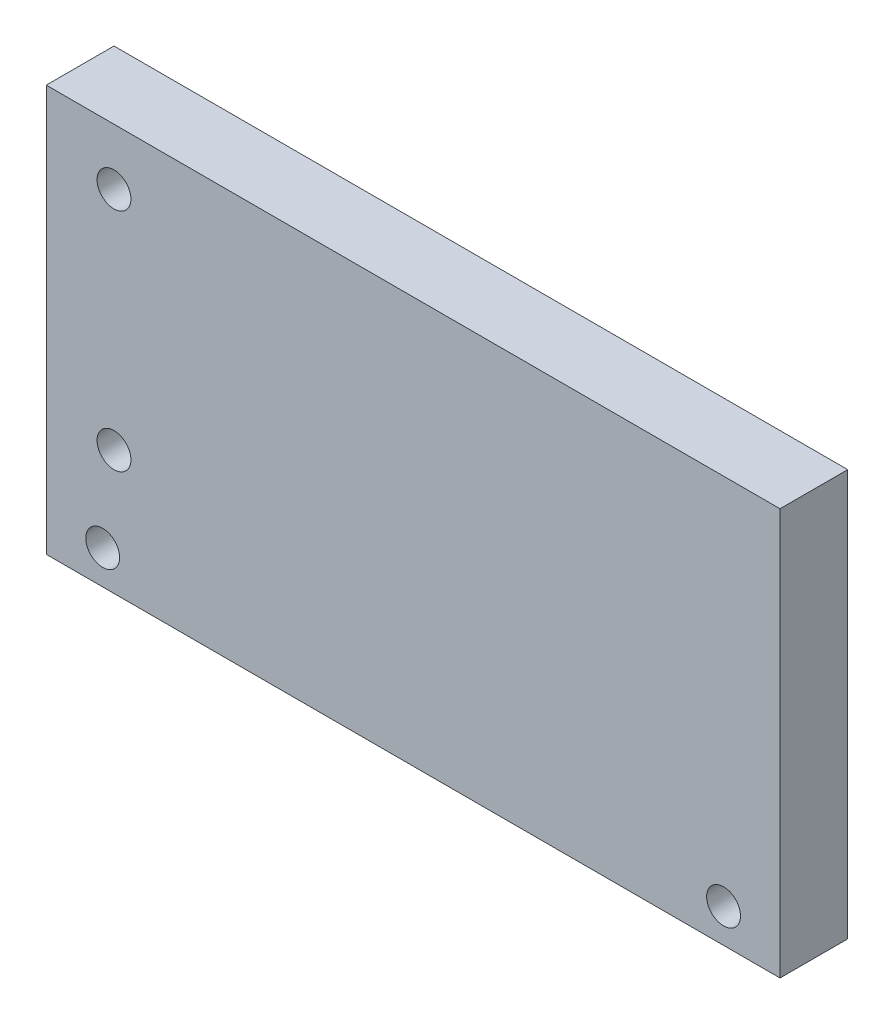
ISO-10303-21;
HEADER;
FILE_DESCRIPTION(('STEP AP214'),'2;1');
FILE_NAME('part.step','',(''),(''),'','','');
FILE_SCHEMA(('AUTOMOTIVE_DESIGN { 1 0 10303 214 1 1 1 1 }'));
ENDSEC;
DATA;
#1=APPLICATION_CONTEXT('core data for automotive mechanical design processes');
#2=APPLICATION_PROTOCOL_DEFINITION('international standard','automotive_design',2000,#1);
#3=PRODUCT_CONTEXT('',#1,'mechanical');
#4=PRODUCT('Part','Part','',(#3));
#5=PRODUCT_RELATED_PRODUCT_CATEGORY('part','',(#4));
#6=PRODUCT_DEFINITION_FORMATION('','',#4);
#7=PRODUCT_DEFINITION_CONTEXT('part definition',#1,'design');
#8=PRODUCT_DEFINITION('design','',#6,#7);
#9=PRODUCT_DEFINITION_SHAPE('','',#8);
#10=(LENGTH_UNIT() NAMED_UNIT(*) SI_UNIT(.MILLI.,.METRE.));
#11=(NAMED_UNIT(*) PLANE_ANGLE_UNIT() SI_UNIT($,.RADIAN.));
#12=(NAMED_UNIT(*) SI_UNIT($,.STERADIAN.) SOLID_ANGLE_UNIT());
#13=UNCERTAINTY_MEASURE_WITH_UNIT(LENGTH_MEASURE(1.E-05),#10,'distance_accuracy_value','');
#14=(GEOMETRIC_REPRESENTATION_CONTEXT(3) GLOBAL_UNCERTAINTY_ASSIGNED_CONTEXT((#13)) GLOBAL_UNIT_ASSIGNED_CONTEXT((#10,
#11,#12)) REPRESENTATION_CONTEXT('',''));
#15=CARTESIAN_POINT('',(0.,0.,0.));
#16=DIRECTION('',(0.,0.,1.));
#17=DIRECTION('',(1.,0.,0.));
#18=AXIS2_PLACEMENT_3D('',#15,#16,#17);
#19=CARTESIAN_POINT('',(0.,0.,6.));
#20=DIRECTION('',(0.,0.,1.));
#21=DIRECTION('',(1.,0.,0.));
#22=AXIS2_PLACEMENT_3D('',#19,#20,#21);
#23=PLANE('',#22);
#24=CARTESIAN_POINT('',(19.7287790550811,3.63194444444443,6.));
#25=DIRECTION('',(0.,0.,1.));
#26=DIRECTION('',(1.,0.,0.));
#27=AXIS2_PLACEMENT_3D('',#24,#25,#26);
#28=CIRCLE('',#27,1.5);
#29=CARTESIAN_POINT('',(21.2287790550811,3.63194444444443,6.));
#30=VERTEX_POINT('',#29);
#31=EDGE_CURVE('E121',#30,#30,#28,.T.);
#32=ORIENTED_EDGE('',*,*,#31,.F.);
#33=EDGE_LOOP('',(#32));
#34=FACE_BOUND('',#33,.T.);
#35=CARTESIAN_POINT('',(-35.2712209449189,3.63194444444444,6.));
#36=DIRECTION('',(0.,0.,1.));
#37=DIRECTION('',(1.,0.,0.));
#38=AXIS2_PLACEMENT_3D('',#35,#36,#37);
#39=CIRCLE('',#38,1.5);
#40=CARTESIAN_POINT('',(-33.7712209449189,3.63194444444444,6.));
#41=VERTEX_POINT('',#40);
#42=EDGE_CURVE('E110',#41,#41,#39,.T.);
#43=ORIENTED_EDGE('',*,*,#42,.F.);
#44=EDGE_LOOP('',(#43));
#45=FACE_BOUND('',#44,.T.);
#46=CARTESIAN_POINT('',(-34.2712209449189,31.6319444444444,6.));
#47=DIRECTION('',(0.,0.,1.));
#48=DIRECTION('',(1.,0.,0.));
#49=AXIS2_PLACEMENT_3D('',#46,#47,#48);
#50=CIRCLE('',#49,1.5);
#51=CARTESIAN_POINT('',(-32.7712209449189,31.6319444444444,6.));
#52=VERTEX_POINT('',#51);
#53=EDGE_CURVE('E102',#52,#52,#50,.T.);
#54=ORIENTED_EDGE('',*,*,#53,.F.);
#55=EDGE_LOOP('',(#54));
#56=FACE_BOUND('',#55,.T.);
#57=DIRECTION('',(0.,-1.,0.));
#58=VECTOR('',#57,1.);
#59=CARTESIAN_POINT('',(-40.2712209449189,36.6319444444444,6.));
#60=LINE('',#59,#58);
#61=CARTESIAN_POINT('',(-40.2712209449189,36.6319444444444,6.));
#62=VERTEX_POINT('',#61);
#63=CARTESIAN_POINT('',(-40.2712209449189,0.631944444444435,6.));
#64=VERTEX_POINT('',#63);
#65=EDGE_CURVE('E86',#62,#64,#60,.T.);
#66=ORIENTED_EDGE('',*,*,#65,.T.);
#67=DIRECTION('',(1.,0.,0.));
#68=VECTOR('',#67,1.);
#69=CARTESIAN_POINT('',(-40.2712209449189,0.631944444444435,6.));
#70=LINE('',#69,#68);
#71=CARTESIAN_POINT('',(24.7287790550811,0.631944444444435,6.));
#72=VERTEX_POINT('',#71);
#73=EDGE_CURVE('E81',#64,#72,#70,.T.);
#74=ORIENTED_EDGE('',*,*,#73,.T.);
#75=DIRECTION('',(0.,1.,0.));
#76=VECTOR('',#75,1.);
#77=CARTESIAN_POINT('',(24.7287790550811,36.6319444444444,6.));
#78=LINE('',#77,#76);
#79=CARTESIAN_POINT('',(24.7287790550811,36.6319444444444,6.));
#80=VERTEX_POINT('',#79);
#81=EDGE_CURVE('E84',#72,#80,#78,.T.);
#82=ORIENTED_EDGE('',*,*,#81,.T.);
#83=DIRECTION('',(-1.,0.,0.));
#84=VECTOR('',#83,1.);
#85=CARTESIAN_POINT('',(-40.2712209449189,36.6319444444444,6.));
#86=LINE('',#85,#84);
#87=EDGE_CURVE('E51',#80,#62,#86,.T.);
#88=ORIENTED_EDGE('',*,*,#87,.T.);
#89=EDGE_LOOP('',(#66,#74,#82,#88));
#90=FACE_BOUND('',#89,.T.);
#91=CARTESIAN_POINT('',(-34.2712209449189,11.6319444444444,6.));
#92=DIRECTION('',(0.,0.,1.));
#93=DIRECTION('',(1.,0.,0.));
#94=AXIS2_PLACEMENT_3D('',#91,#92,#93);
#95=CIRCLE('',#94,1.5);
#96=CARTESIAN_POINT('',(-32.7712209449189,11.6319444444444,6.));
#97=VERTEX_POINT('',#96);
#98=EDGE_CURVE('E114',#97,#97,#95,.T.);
#99=ORIENTED_EDGE('',*,*,#98,.F.);
#100=EDGE_LOOP('',(#99));
#101=FACE_BOUND('',#100,.T.);
#102=ADVANCED_FACE('F32',(#34,#45,#56,#90,#101),#23,.T.);
#103=CARTESIAN_POINT('',(0.,0.,0.));
#104=DIRECTION('',(0.,0.,1.));
#105=DIRECTION('',(1.,0.,0.));
#106=AXIS2_PLACEMENT_3D('',#103,#104,#105);
#107=PLANE('',#106);
#108=CARTESIAN_POINT('',(19.7287790550811,3.63194444444443,0.));
#109=DIRECTION('',(0.,0.,1.));
#110=DIRECTION('',(1.,0.,0.));
#111=AXIS2_PLACEMENT_3D('',#108,#109,#110);
#112=CIRCLE('',#111,1.5);
#113=CARTESIAN_POINT('',(21.2287790550811,3.63194444444443,0.));
#114=VERTEX_POINT('',#113);
#115=EDGE_CURVE('E36',#114,#114,#112,.T.);
#116=ORIENTED_EDGE('',*,*,#115,.T.);
#117=EDGE_LOOP('',(#116));
#118=FACE_BOUND('',#117,.T.);
#119=CARTESIAN_POINT('',(-35.2712209449189,3.63194444444444,0.));
#120=DIRECTION('',(0.,0.,1.));
#121=DIRECTION('',(1.,0.,0.));
#122=AXIS2_PLACEMENT_3D('',#119,#120,#121);
#123=CIRCLE('',#122,1.5);
#124=CARTESIAN_POINT('',(-33.7712209449189,3.63194444444444,0.));
#125=VERTEX_POINT('',#124);
#126=EDGE_CURVE('E107',#125,#125,#123,.T.);
#127=ORIENTED_EDGE('',*,*,#126,.T.);
#128=EDGE_LOOP('',(#127));
#129=FACE_BOUND('',#128,.T.);
#130=DIRECTION('',(0.,-1.,0.));
#131=VECTOR('',#130,1.);
#132=CARTESIAN_POINT('',(-40.2712209449189,36.6319444444444,0.));
#133=LINE('',#132,#131);
#134=CARTESIAN_POINT('',(-40.2712209449189,36.6319444444444,0.));
#135=VERTEX_POINT('',#134);
#136=CARTESIAN_POINT('',(-40.2712209449189,0.631944444444435,0.));
#137=VERTEX_POINT('',#136);
#138=EDGE_CURVE('E99',#135,#137,#133,.T.);
#139=ORIENTED_EDGE('',*,*,#138,.F.);
#140=DIRECTION('',(-1.,0.,0.));
#141=VECTOR('',#140,1.);
#142=CARTESIAN_POINT('',(-40.2712209449189,36.6319444444444,0.));
#143=LINE('',#142,#141);
#144=CARTESIAN_POINT('',(24.7287790550811,36.6319444444444,0.));
#145=VERTEX_POINT('',#144);
#146=EDGE_CURVE('E74',#145,#135,#143,.T.);
#147=ORIENTED_EDGE('',*,*,#146,.F.);
#148=DIRECTION('',(0.,1.,0.));
#149=VECTOR('',#148,1.);
#150=CARTESIAN_POINT('',(24.7287790550811,36.6319444444444,0.));
#151=LINE('',#150,#149);
#152=CARTESIAN_POINT('',(24.7287790550811,0.631944444444435,0.));
#153=VERTEX_POINT('',#152);
#154=EDGE_CURVE('E68',#153,#145,#151,.T.);
#155=ORIENTED_EDGE('',*,*,#154,.F.);
#156=DIRECTION('',(1.,0.,0.));
#157=VECTOR('',#156,1.);
#158=CARTESIAN_POINT('',(-40.2712209449189,0.631944444444435,0.));
#159=LINE('',#158,#157);
#160=EDGE_CURVE('E90',#137,#153,#159,.T.);
#161=ORIENTED_EDGE('',*,*,#160,.F.);
#162=EDGE_LOOP('',(#139,#147,#155,#161));
#163=FACE_BOUND('',#162,.T.);
#164=CARTESIAN_POINT('',(-34.2712209449189,31.6319444444444,0.));
#165=DIRECTION('',(0.,0.,1.));
#166=DIRECTION('',(1.,0.,0.));
#167=AXIS2_PLACEMENT_3D('',#164,#165,#166);
#168=CIRCLE('',#167,1.5);
#169=CARTESIAN_POINT('',(-32.7712209449189,31.6319444444444,0.));
#170=VERTEX_POINT('',#169);
#171=EDGE_CURVE('E125',#170,#170,#168,.T.);
#172=ORIENTED_EDGE('',*,*,#171,.T.);
#173=EDGE_LOOP('',(#172));
#174=FACE_BOUND('',#173,.T.);
#175=CARTESIAN_POINT('',(-34.2712209449189,11.6319444444444,0.));
#176=DIRECTION('',(0.,0.,1.));
#177=DIRECTION('',(1.,0.,0.));
#178=AXIS2_PLACEMENT_3D('',#175,#176,#177);
#179=CIRCLE('',#178,1.5);
#180=CARTESIAN_POINT('',(-32.7712209449189,11.6319444444444,0.));
#181=VERTEX_POINT('',#180);
#182=EDGE_CURVE('E109',#181,#181,#179,.T.);
#183=ORIENTED_EDGE('',*,*,#182,.T.);
#184=EDGE_LOOP('',(#183));
#185=FACE_BOUND('',#184,.T.);
#186=ADVANCED_FACE('F132',(#118,#129,#163,#174,#185),#107,.F.);
#187=CARTESIAN_POINT('',(-40.2712209449189,36.6319444444444,6.));
#188=DIRECTION('',(1.,0.,0.));
#189=DIRECTION('',(0.,1.,0.));
#190=AXIS2_PLACEMENT_3D('',#187,#188,#189);
#191=PLANE('',#190);
#192=ORIENTED_EDGE('',*,*,#138,.T.);
#193=DIRECTION('',(0.,0.,-1.));
#194=VECTOR('',#193,1.);
#195=CARTESIAN_POINT('',(-40.2712209449189,0.631944444444435,6.));
#196=LINE('',#195,#194);
#197=EDGE_CURVE('E11',#64,#137,#196,.T.);
#198=ORIENTED_EDGE('',*,*,#197,.F.);
#199=ORIENTED_EDGE('',*,*,#65,.F.);
#200=DIRECTION('',(0.,0.,-1.));
#201=VECTOR('',#200,1.);
#202=CARTESIAN_POINT('',(-40.2712209449189,36.6319444444444,6.));
#203=LINE('',#202,#201);
#204=EDGE_CURVE('E95',#62,#135,#203,.T.);
#205=ORIENTED_EDGE('',*,*,#204,.T.);
#206=EDGE_LOOP('',(#192,#198,#199,#205));
#207=FACE_BOUND('',#206,.T.);
#208=ADVANCED_FACE('F34',(#207),#191,.F.);
#209=CARTESIAN_POINT('',(-40.2712209449189,0.631944444444435,6.));
#210=DIRECTION('',(0.,1.,0.));
#211=DIRECTION('',(0.,0.,1.));
#212=AXIS2_PLACEMENT_3D('',#209,#210,#211);
#213=PLANE('',#212);
#214=ORIENTED_EDGE('',*,*,#160,.T.);
#215=DIRECTION('',(0.,0.,-1.));
#216=VECTOR('',#215,1.);
#217=CARTESIAN_POINT('',(24.7287790550811,0.631944444444435,6.));
#218=LINE('',#217,#216);
#219=EDGE_CURVE('E42',#72,#153,#218,.T.);
#220=ORIENTED_EDGE('',*,*,#219,.F.);
#221=ORIENTED_EDGE('',*,*,#73,.F.);
#222=ORIENTED_EDGE('',*,*,#197,.T.);
#223=EDGE_LOOP('',(#214,#220,#221,#222));
#224=FACE_BOUND('',#223,.T.);
#225=ADVANCED_FACE('F89',(#224),#213,.F.);
#226=CARTESIAN_POINT('',(24.7287790550811,36.6319444444444,6.));
#227=DIRECTION('',(-1.,0.,0.));
#228=DIRECTION('',(0.,-1.,0.));
#229=AXIS2_PLACEMENT_3D('',#226,#227,#228);
#230=PLANE('',#229);
#231=ORIENTED_EDGE('',*,*,#154,.T.);
#232=DIRECTION('',(0.,0.,-1.));
#233=VECTOR('',#232,1.);
#234=CARTESIAN_POINT('',(24.7287790550811,36.6319444444444,6.));
#235=LINE('',#234,#233);
#236=EDGE_CURVE('E91',#80,#145,#235,.T.);
#237=ORIENTED_EDGE('',*,*,#236,.F.);
#238=ORIENTED_EDGE('',*,*,#81,.F.);
#239=ORIENTED_EDGE('',*,*,#219,.T.);
#240=EDGE_LOOP('',(#231,#237,#238,#239));
#241=FACE_BOUND('',#240,.T.);
#242=ADVANCED_FACE('F93',(#241),#230,.F.);
#243=CARTESIAN_POINT('',(-40.2712209449189,36.6319444444444,6.));
#244=DIRECTION('',(0.,-1.,0.));
#245=DIRECTION('',(0.,0.,-1.));
#246=AXIS2_PLACEMENT_3D('',#243,#244,#245);
#247=PLANE('',#246);
#248=ORIENTED_EDGE('',*,*,#146,.T.);
#249=ORIENTED_EDGE('',*,*,#204,.F.);
#250=ORIENTED_EDGE('',*,*,#87,.F.);
#251=ORIENTED_EDGE('',*,*,#236,.T.);
#252=EDGE_LOOP('',(#248,#249,#250,#251));
#253=FACE_BOUND('',#252,.T.);
#254=ADVANCED_FACE('F138',(#253),#247,.F.);
#255=CARTESIAN_POINT('',(-34.2712209449189,31.6319444444444,6.));
#256=DIRECTION('',(0.,0.,-1.));
#257=DIRECTION('',(-1.,0.,0.));
#258=AXIS2_PLACEMENT_3D('',#255,#256,#257);
#259=CYLINDRICAL_SURFACE('',#258,1.5);
#260=ORIENTED_EDGE('',*,*,#53,.T.);
#261=EDGE_LOOP('',(#260));
#262=FACE_BOUND('',#261,.T.);
#263=ORIENTED_EDGE('',*,*,#171,.F.);
#264=EDGE_LOOP('',(#263));
#265=FACE_BOUND('',#264,.T.);
#266=ADVANCED_FACE('F135',(#262,#265),#259,.F.);
#267=CARTESIAN_POINT('',(-34.2712209449189,11.6319444444444,6.));
#268=DIRECTION('',(0.,0.,-1.));
#269=DIRECTION('',(-1.,0.,0.));
#270=AXIS2_PLACEMENT_3D('',#267,#268,#269);
#271=CYLINDRICAL_SURFACE('',#270,1.5);
#272=ORIENTED_EDGE('',*,*,#98,.T.);
#273=EDGE_LOOP('',(#272));
#274=FACE_BOUND('',#273,.T.);
#275=ORIENTED_EDGE('',*,*,#182,.F.);
#276=EDGE_LOOP('',(#275));
#277=FACE_BOUND('',#276,.T.);
#278=ADVANCED_FACE('F137',(#274,#277),#271,.F.);
#279=CARTESIAN_POINT('',(-35.2712209449189,3.63194444444444,-4.));
#280=DIRECTION('',(0.,0.,1.));
#281=DIRECTION('',(1.,0.,0.));
#282=AXIS2_PLACEMENT_3D('',#279,#280,#281);
#283=CYLINDRICAL_SURFACE('',#282,1.5);
#284=ORIENTED_EDGE('',*,*,#42,.T.);
#285=EDGE_LOOP('',(#284));
#286=FACE_BOUND('',#285,.T.);
#287=ORIENTED_EDGE('',*,*,#126,.F.);
#288=EDGE_LOOP('',(#287));
#289=FACE_BOUND('',#288,.T.);
#290=ADVANCED_FACE('F145',(#286,#289),#283,.F.);
#291=CARTESIAN_POINT('',(19.7287790550811,3.63194444444443,-4.));
#292=DIRECTION('',(0.,0.,1.));
#293=DIRECTION('',(1.,0.,0.));
#294=AXIS2_PLACEMENT_3D('',#291,#292,#293);
#295=CYLINDRICAL_SURFACE('',#294,1.5);
#296=ORIENTED_EDGE('',*,*,#31,.T.);
#297=EDGE_LOOP('',(#296));
#298=FACE_BOUND('',#297,.T.);
#299=ORIENTED_EDGE('',*,*,#115,.F.);
#300=EDGE_LOOP('',(#299));
#301=FACE_BOUND('',#300,.T.);
#302=ADVANCED_FACE('F186',(#298,#301),#295,.F.);
#303=CLOSED_SHELL('',(#102,#186,#208,#225,#242,#254,#266,#278,#290,#302));
#304=MANIFOLD_SOLID_BREP('B2',#303);
#305=ADVANCED_BREP_SHAPE_REPRESENTATION('',(#18,#304),#14);
#306=SHAPE_DEFINITION_REPRESENTATION(#9,#305);
ENDSEC;
END-ISO-10303-21;
